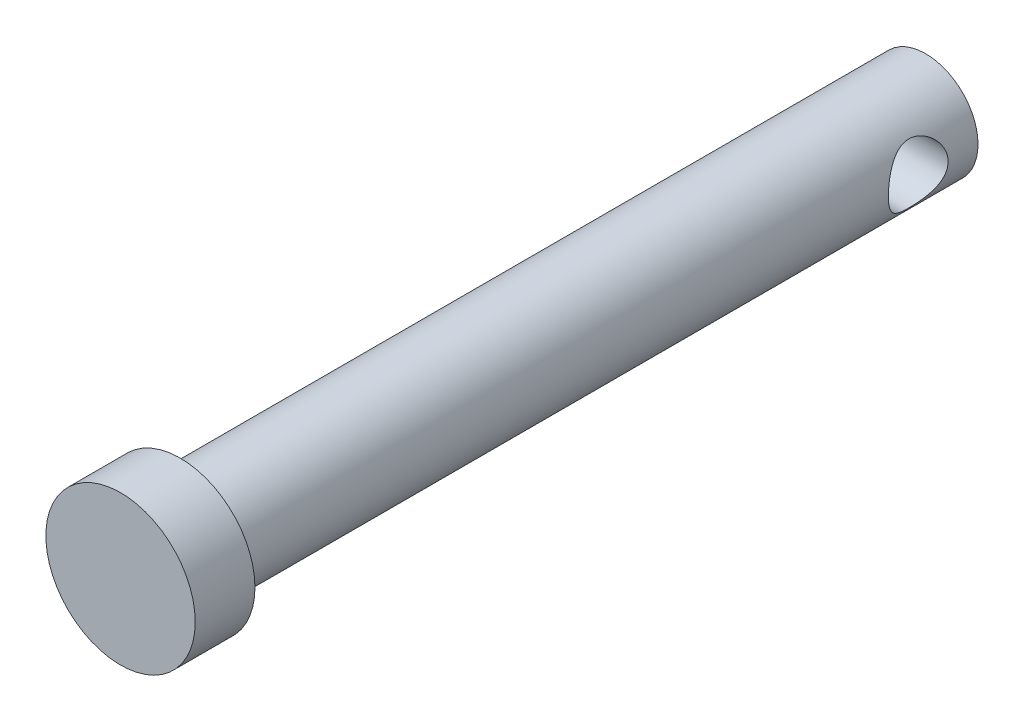
ISO-10303-21;
HEADER;
FILE_DESCRIPTION(('STEP AP214'),'2;1');
FILE_NAME('part.step','',(''),(''),'','','');
FILE_SCHEMA(('AUTOMOTIVE_DESIGN { 1 0 10303 214 1 1 1 1 }'));
ENDSEC;
DATA;
#1=APPLICATION_CONTEXT('core data for automotive mechanical design processes');
#2=APPLICATION_PROTOCOL_DEFINITION('international standard','automotive_design',2000,#1);
#3=PRODUCT_CONTEXT('',#1,'mechanical');
#4=PRODUCT('Part','Part','',(#3));
#5=PRODUCT_RELATED_PRODUCT_CATEGORY('part','',(#4));
#6=PRODUCT_DEFINITION_FORMATION('','',#4);
#7=PRODUCT_DEFINITION_CONTEXT('part definition',#1,'design');
#8=PRODUCT_DEFINITION('design','',#6,#7);
#9=PRODUCT_DEFINITION_SHAPE('','',#8);
#10=(LENGTH_UNIT() NAMED_UNIT(*) SI_UNIT(.MILLI.,.METRE.));
#11=(NAMED_UNIT(*) PLANE_ANGLE_UNIT() SI_UNIT($,.RADIAN.));
#12=(NAMED_UNIT(*) SI_UNIT($,.STERADIAN.) SOLID_ANGLE_UNIT());
#13=UNCERTAINTY_MEASURE_WITH_UNIT(LENGTH_MEASURE(1.E-05),#10,'distance_accuracy_value','');
#14=(GEOMETRIC_REPRESENTATION_CONTEXT(3) GLOBAL_UNCERTAINTY_ASSIGNED_CONTEXT((#13)) GLOBAL_UNIT_ASSIGNED_CONTEXT((#10,
#11,#12)) REPRESENTATION_CONTEXT('',''));
#15=CARTESIAN_POINT('',(0.,0.,0.));
#16=DIRECTION('',(0.,0.,1.));
#17=DIRECTION('',(1.,0.,0.));
#18=AXIS2_PLACEMENT_3D('',#15,#16,#17);
#19=CARTESIAN_POINT('',(0.,0.,0.));
#20=DIRECTION('',(0.,0.,1.));
#21=DIRECTION('',(1.,0.,0.));
#22=AXIS2_PLACEMENT_3D('',#19,#20,#21);
#23=CYLINDRICAL_SURFACE('',#22,8.75000000000001);
#24=CARTESIAN_POINT('',(8.75000000000001,0.,-57.5));
#25=CARTESIAN_POINT('',(8.74999899143932,-0.128967860426041,-57.4999988873856));
#26=CARTESIAN_POINT('',(8.74714118512553,-0.257975693991092,-57.4950022919481));
#27=CARTESIAN_POINT('',(8.73577804717564,-0.51502827530827,-57.4750761872122));
#28=CARTESIAN_POINT('',(8.72726918470832,-0.64307237029098,-57.4601404678472));
#29=CARTESIAN_POINT('',(8.70479591949282,-0.89741660904972,-57.4204917876841));
#30=CARTESIAN_POINT('',(8.69082066571583,-1.02371276357046,-57.3957593787775));
#31=CARTESIAN_POINT('',(8.65775561349406,-1.27343788282964,-57.3368198741511));
#32=CARTESIAN_POINT('',(8.63866363326812,-1.39686560000649,-57.3026087364739));
#33=CARTESIAN_POINT('',(8.59593192338099,-1.63936832817797,-57.2253125486778));
#34=CARTESIAN_POINT('',(8.57231648957784,-1.75846272056558,-57.1822748233246));
#35=CARTESIAN_POINT('',(8.52100513710846,-1.99231796977077,-57.0876574432639));
#36=CARTESIAN_POINT('',(8.49330766863481,-2.10707715977998,-57.0360745433224));
#37=CARTESIAN_POINT('',(8.40500554554115,-2.44378000950736,-56.8692760914431));
#38=CARTESIAN_POINT('',(8.33913351906791,-2.65846282664718,-56.7419094513411));
#39=CARTESIAN_POINT('',(8.19352835070925,-3.07924983168927,-56.4482667833856));
#40=CARTESIAN_POINT('',(8.11313763322376,-3.28361386492949,-56.2798445741146));
#41=CARTESIAN_POINT('',(7.94911679986266,-3.66289479952946,-55.9136259114097));
#42=CARTESIAN_POINT('',(7.86548297155776,-3.83777665031337,-55.7157950130608));
#43=CARTESIAN_POINT('',(7.69368241141025,-4.17238820695879,-55.2706942694034));
#44=CARTESIAN_POINT('',(7.60601081901439,-4.32840579236466,-55.0203880725344));
#45=CARTESIAN_POINT('',(7.48732871733404,-4.528627618394,-54.624480201928));
#46=CARTESIAN_POINT('',(7.44990905356926,-4.58972916126812,-54.4891191953705));
#47=CARTESIAN_POINT('',(7.38080725810791,-4.70004229445467,-54.2122516722928));
#48=CARTESIAN_POINT('',(7.34912325246575,-4.74925776992735,-54.0707471817639));
#49=CARTESIAN_POINT('',(7.27734050690413,-4.85893908118856,-53.7022424297169));
#50=CARTESIAN_POINT('',(7.24235738727829,-4.91044657846494,-53.471449434678));
#51=CARTESIAN_POINT('',(7.19452423963996,-4.98027881195367,-53.0028474709525));
#52=CARTESIAN_POINT('',(7.18165048675389,-4.99863911847061,-52.7650463016897));
#53=CARTESIAN_POINT('',(7.17985715136126,-5.00121579927444,-52.2888208812959));
#54=CARTESIAN_POINT('',(7.1909702823687,-4.98538554416675,-52.0503962227266));
#55=CARTESIAN_POINT('',(7.23557305100397,-4.92041312900133,-51.5802416033727));
#56=CARTESIAN_POINT('',(7.26907808435353,-4.87124804899479,-51.3485163632644));
#57=CARTESIAN_POINT('',(7.3538425515404,-4.74229410579026,-50.898338603151));
#58=CARTESIAN_POINT('',(7.40503287513213,-4.66262431898962,-50.6798382526693));
#59=CARTESIAN_POINT('',(7.51964771342102,-4.47542302998303,-50.2586237762793));
#60=CARTESIAN_POINT('',(7.58307690661132,-4.3678808677269,-50.0559157289483));
#61=CARTESIAN_POINT('',(7.7273177822965,-4.10810250362094,-49.6375740729523));
#62=CARTESIAN_POINT('',(7.80928613895577,-3.95146575714067,-49.4250747708425));
#63=CARTESIAN_POINT('',(7.97430872465577,-3.60684973623075,-49.02726405411));
#64=CARTESIAN_POINT('',(8.05736382322822,-3.41884374454083,-48.8419760705338));
#65=CARTESIAN_POINT('',(8.18178145620827,-3.10413963819043,-48.5775027309462));
#66=CARTESIAN_POINT('',(8.22533305073232,-2.9871162606479,-48.4876423991071));
#67=CARTESIAN_POINT('',(8.30931859089603,-2.74483760429682,-48.3181703377285));
#68=CARTESIAN_POINT('',(8.3497537012993,-2.61958543368039,-48.2385547717593));
#69=CARTESIAN_POINT('',(8.42637298223244,-2.36153627714243,-48.0903192052456));
#70=CARTESIAN_POINT('',(8.46255812652809,-2.2287410299006,-48.0216966846231));
#71=CARTESIAN_POINT('',(8.52962889317403,-1.9564208893549,-47.896209960206));
#72=CARTESIAN_POINT('',(8.56051517261517,-1.81689683321645,-47.8393442983112));
#73=CARTESIAN_POINT('',(8.6141154702888,-1.54199613747236,-47.7416352392982));
#74=CARTESIAN_POINT('',(8.63724632571279,-1.40699760303387,-47.69995704177));
#75=CARTESIAN_POINT('',(8.67742510216704,-1.13311132129589,-47.6280293801526));
#76=CARTESIAN_POINT('',(8.69447388312316,-0.994224126799221,-47.5977783003826));
#77=CARTESIAN_POINT('',(8.72196949323287,-0.713845010655519,-47.549176492856));
#78=CARTESIAN_POINT('',(8.73242139825561,-0.572355178055298,-47.5308166153035));
#79=CARTESIAN_POINT('',(8.74641743156534,-0.28798961500806,-47.5062617831562));
#80=CARTESIAN_POINT('',(8.74996233310143,-0.145114041496759,-47.5000654668324));
#81=CARTESIAN_POINT('',(8.75003254494902,0.123248535843138,-47.4999434418316));
#82=CARTESIAN_POINT('',(8.74735900095685,0.248737407032813,-47.5046172839));
#83=CARTESIAN_POINT('',(8.73666673854353,0.498821247290905,-47.5233640608992));
#84=CARTESIAN_POINT('',(8.72864638198892,0.623415930573509,-47.5374398763688));
#85=CARTESIAN_POINT('',(8.70745272957524,0.870721875400301,-47.57481254268));
#86=CARTESIAN_POINT('',(8.69428142228786,0.993433844806834,-47.5981058350714));
#87=CARTESIAN_POINT('',(8.66310017076885,1.23620833725116,-47.6536278698592));
#88=CARTESIAN_POINT('',(8.64508836060878,1.35626981921844,-47.6858600581957));
#89=CARTESIAN_POINT('',(8.58480031554475,1.70878109528973,-47.7946852636441));
#90=CARTESIAN_POINT('',(8.53601467526877,1.93638580026293,-47.8838451948721));
#91=CARTESIAN_POINT('',(8.42498494962223,2.37342763213177,-48.092546421804));
#92=CARTESIAN_POINT('',(8.36273762440095,2.58286036851134,-48.2120950324293));
#93=CARTESIAN_POINT('',(8.22243746460455,3.00126278411985,-48.4922324105876));
#94=CARTESIAN_POINT('',(8.14341387017987,3.20791515993108,-48.6557977556155));
#95=CARTESIAN_POINT('',(7.98126456368134,3.59243377528926,-49.0124047429156));
#96=CARTESIAN_POINT('',(7.89813423286805,3.77026659409319,-49.205480109763));
#97=CARTESIAN_POINT('',(7.7260544036741,4.11231717915448,-49.6410061251103));
#98=CARTESIAN_POINT('',(7.63748994897739,4.27280439758791,-49.8865619467716));
#99=CARTESIAN_POINT('',(7.47578366869892,4.54983467735247,-50.405886628181));
#100=CARTESIAN_POINT('',(7.4026214043184,4.66643613940155,-50.6796173717617));
#101=CARTESIAN_POINT('',(7.29628083803207,4.83055268275963,-51.1880881486004));
#102=CARTESIAN_POINT('',(7.25790263663577,4.88749883180399,-51.4186912174902));
#103=CARTESIAN_POINT('',(7.2029758105187,4.96810842213104,-51.8880852409359));
#104=CARTESIAN_POINT('',(7.18640234813968,4.99180973446422,-52.1268665608823));
#105=CARTESIAN_POINT('',(7.1774827895993,5.0046298227655,-52.6063068957164));
#106=CARTESIAN_POINT('',(7.18518547042859,4.99367897348607,-52.8469687205626));
#107=CARTESIAN_POINT('',(7.22375354547912,4.93770946687113,-53.3224429825996));
#108=CARTESIAN_POINT('',(7.25463358954822,4.89266926233159,-53.5572516231065));
#109=CARTESIAN_POINT('',(7.33459503620321,4.77192657388339,-54.0109386947904));
#110=CARTESIAN_POINT('',(7.38335227025487,4.6967680992956,-54.2300224601053));
#111=CARTESIAN_POINT('',(7.49373941466472,4.51855300291661,-54.6529991754065));
#112=CARTESIAN_POINT('',(7.55537407001274,4.41548609344827,-54.8568864882245));
#113=CARTESIAN_POINT('',(7.69608556942828,4.16608669020863,-55.2771021502592));
#114=CARTESIAN_POINT('',(7.77638680459788,4.01553579229108,-55.490511731197));
#115=CARTESIAN_POINT('',(7.93907840273347,3.68343512853148,-55.8911688262313));
#116=CARTESIAN_POINT('',(8.02147052488323,3.50185846942674,-56.0783933848241));
#117=CARTESIAN_POINT('',(8.1461873024024,3.19629661700371,-56.3477551965533));
#118=CARTESIAN_POINT('',(8.19028295366971,3.08183258742075,-56.440053916032));
#119=CARTESIAN_POINT('',(8.27568243976121,2.84454773116869,-56.6146351736945));
#120=CARTESIAN_POINT('',(8.31698728498757,2.72172996161156,-56.6969213456238));
#121=CARTESIAN_POINT('',(8.39566853903589,2.46836977835854,-56.8507604859725));
#122=CARTESIAN_POINT('',(8.43304532816924,2.33782811440055,-56.922314493759));
#123=CARTESIAN_POINT('',(8.50279673917487,2.06980770077492,-57.0539178187812));
#124=CARTESIAN_POINT('',(8.53517273869683,1.93233087554458,-57.1139703056278));
#125=CARTESIAN_POINT('',(8.58871834374186,1.67640860202281,-57.2122139177791));
#126=CARTESIAN_POINT('',(8.61085695040126,1.55892525419862,-57.2523935608994));
#127=CARTESIAN_POINT('',(8.65061331029371,1.32059631066416,-57.3240544006406));
#128=CARTESIAN_POINT('',(8.66823186304956,1.1997513137715,-57.3555371356764));
#129=CARTESIAN_POINT('',(8.69851197885606,0.955755229239806,-57.4093894710432));
#130=CARTESIAN_POINT('',(8.71118564012015,0.832610552226699,-57.4317813187339));
#131=CARTESIAN_POINT('',(8.7313332081311,0.584617815083984,-57.4672824637319));
#132=CARTESIAN_POINT('',(8.73881007306015,0.459770765337694,-57.4803970420325));
#133=CARTESIAN_POINT('',(8.74573194749783,0.278891824250344,-57.4925278355362));
#134=CARTESIAN_POINT('',(8.74733140190726,0.223168056039698,-57.495328726467));
#135=CARTESIAN_POINT('',(8.74946570226123,0.111632027086561,-57.499065147321));
#136=CARTESIAN_POINT('',(8.75000043652438,0.0558197576753702,-57.5000004815608));
#137=CARTESIAN_POINT('',(8.75000000000001,0.,-57.5));
#138=B_SPLINE_CURVE_WITH_KNOTS('',3,(#24,#25,#26,#27,#28,#29,#30,#31,#32,#33,#34,#35,#36,#37,
#38,#39,#40,#41,#42,#43,#44,#45,#46,#47,#48,#49,#50,#51,#52,#53,#54,#55,#56,#57,#58,#59,#60,#61,
#62,#63,#64,#65,#66,#67,#68,#69,#70,#71,#72,#73,#74,#75,#76,#77,#78,#79,#80,#81,#82,#83,#84,#85,
#86,#87,#88,#89,#90,#91,#92,#93,#94,#95,#96,#97,#98,#99,#100,#101,#102,#103,#104,#105,#106,#107,
#108,#109,#110,#111,#112,#113,#114,#115,#116,#117,#118,#119,#120,#121,#122,#123,#124,#125,#126,
#127,#128,#129,#130,#131,#132,#133,#134,#135,#136,#137),.UNSPECIFIED.,.T.,.F.,(4,2,2,2,2,2,2,2,
2,2,2,2,2,2,2,2,2,2,2,2,2,2,2,2,2,2,2,2,2,2,2,2,2,2,2,2,2,2,2,2,2,2,2,2,2,2,2,2,2,2,2,2,2,2,2,2,
4),(0.,0.386845405058941,0.773932742319245,1.16179239674328,1.54981769906418,1.93581453569218,
2.32195830131254,3.0932526896355,3.92026707841388,4.74825785270365,5.66623148603118,
6.12511505478498,6.58384842613308,7.29762978219456,8.01064472200142,8.72463269194207,
9.4391120754447,10.1508304331471,10.8628213968974,11.6889099035546,12.5157056172,
12.9767172228832,13.4375556847493,13.8982883509996,14.3589638422894,14.787852636959,
15.2166807683009,15.6451785406097,16.0736283392116,16.4499800128818,16.8264470445841,
17.2027688809889,17.5792359914215,18.3236540520218,19.0682514729897,19.8903533136246,
20.7134017903678,21.6282450041381,22.5418664545776,23.2606149709009,23.9785440538439,
24.6979165591871,25.4177441457245,26.1251171108573,26.8327511853953,27.6493510191049,
28.4666623095394,28.9267025228087,29.3865752775275,29.8464034666194,30.3061047524798,
30.68407351473,31.0619753743891,31.4389467699392,31.8157034052214,31.9831199386142,
32.1505540318595),.UNSPECIFIED.);
#139=CARTESIAN_POINT('',(8.75000000000001,0.,-57.5));
#140=VERTEX_POINT('',#139);
#141=EDGE_CURVE('E46',#140,#140,#138,.T.);
#142=ORIENTED_EDGE('',*,*,#141,.T.);
#143=EDGE_LOOP('',(#142));
#144=FACE_BOUND('',#143,.T.);
#145=CARTESIAN_POINT('',(-8.75000000000001,0.,-57.5));
#146=CARTESIAN_POINT('',(-8.74999899143932,0.128967860426041,-57.4999988873856));
#147=CARTESIAN_POINT('',(-8.74714118512553,0.257975693991092,-57.4950022919481));
#148=CARTESIAN_POINT('',(-8.73577804717564,0.51502827530827,-57.4750761872122));
#149=CARTESIAN_POINT('',(-8.72726918470832,0.64307237029098,-57.4601404678472));
#150=CARTESIAN_POINT('',(-8.70479591949282,0.89741660904972,-57.4204917876841));
#151=CARTESIAN_POINT('',(-8.69082066571583,1.02371276357046,-57.3957593787775));
#152=CARTESIAN_POINT('',(-8.65775561349406,1.27343788282964,-57.3368198741511));
#153=CARTESIAN_POINT('',(-8.63866363326812,1.39686560000649,-57.3026087364739));
#154=CARTESIAN_POINT('',(-8.59593192338099,1.63936832817797,-57.2253125486778));
#155=CARTESIAN_POINT('',(-8.57231648957784,1.75846272056558,-57.1822748233246));
#156=CARTESIAN_POINT('',(-8.52100513710846,1.99231796977077,-57.0876574432639));
#157=CARTESIAN_POINT('',(-8.49330766863481,2.10707715977998,-57.0360745433224));
#158=CARTESIAN_POINT('',(-8.40500554554115,2.44378000950736,-56.8692760914431));
#159=CARTESIAN_POINT('',(-8.33913351906791,2.65846282664718,-56.7419094513411));
#160=CARTESIAN_POINT('',(-8.19352835070925,3.07924983168927,-56.4482667833856));
#161=CARTESIAN_POINT('',(-8.11313763322376,3.28361386492949,-56.2798445741146));
#162=CARTESIAN_POINT('',(-7.94911679986266,3.66289479952946,-55.9136259114097));
#163=CARTESIAN_POINT('',(-7.86548297155776,3.83777665031337,-55.7157950130608));
#164=CARTESIAN_POINT('',(-7.69368241141025,4.17238820695879,-55.2706942694034));
#165=CARTESIAN_POINT('',(-7.60601081901439,4.32840579236466,-55.0203880725344));
#166=CARTESIAN_POINT('',(-7.48732871733404,4.528627618394,-54.624480201928));
#167=CARTESIAN_POINT('',(-7.44990905356926,4.58972916126812,-54.4891191953705));
#168=CARTESIAN_POINT('',(-7.38080725810791,4.70004229445467,-54.2122516722928));
#169=CARTESIAN_POINT('',(-7.34912325246575,4.74925776992735,-54.0707471817639));
#170=CARTESIAN_POINT('',(-7.27734050690413,4.85893908118856,-53.7022424297169));
#171=CARTESIAN_POINT('',(-7.24235738727829,4.91044657846494,-53.471449434678));
#172=CARTESIAN_POINT('',(-7.19452423963996,4.98027881195367,-53.0028474709525));
#173=CARTESIAN_POINT('',(-7.18165048675389,4.99863911847061,-52.7650463016897));
#174=CARTESIAN_POINT('',(-7.17985715136126,5.00121579927444,-52.2888208812959));
#175=CARTESIAN_POINT('',(-7.1909702823687,4.98538554416675,-52.0503962227266));
#176=CARTESIAN_POINT('',(-7.23557305100397,4.92041312900133,-51.5802416033727));
#177=CARTESIAN_POINT('',(-7.26907808435353,4.87124804899479,-51.3485163632644));
#178=CARTESIAN_POINT('',(-7.3538425515404,4.74229410579026,-50.898338603151));
#179=CARTESIAN_POINT('',(-7.40503287513213,4.66262431898962,-50.6798382526693));
#180=CARTESIAN_POINT('',(-7.51964771342102,4.47542302998303,-50.2586237762793));
#181=CARTESIAN_POINT('',(-7.58307690661132,4.3678808677269,-50.0559157289483));
#182=CARTESIAN_POINT('',(-7.7273177822965,4.10810250362094,-49.6375740729523));
#183=CARTESIAN_POINT('',(-7.80928613895577,3.95146575714067,-49.4250747708425));
#184=CARTESIAN_POINT('',(-7.97430872465577,3.60684973623075,-49.02726405411));
#185=CARTESIAN_POINT('',(-8.05736382322822,3.41884374454083,-48.8419760705338));
#186=CARTESIAN_POINT('',(-8.18178145620827,3.10413963819043,-48.5775027309462));
#187=CARTESIAN_POINT('',(-8.22533305073232,2.9871162606479,-48.4876423991071));
#188=CARTESIAN_POINT('',(-8.30931859089603,2.74483760429682,-48.3181703377285));
#189=CARTESIAN_POINT('',(-8.3497537012993,2.61958543368039,-48.2385547717593));
#190=CARTESIAN_POINT('',(-8.42637298223244,2.36153627714243,-48.0903192052456));
#191=CARTESIAN_POINT('',(-8.46255812652809,2.2287410299006,-48.0216966846231));
#192=CARTESIAN_POINT('',(-8.52962889317403,1.9564208893549,-47.896209960206));
#193=CARTESIAN_POINT('',(-8.56051517261517,1.81689683321645,-47.8393442983112));
#194=CARTESIAN_POINT('',(-8.6141154702888,1.54199613747236,-47.7416352392982));
#195=CARTESIAN_POINT('',(-8.63724632571279,1.40699760303387,-47.69995704177));
#196=CARTESIAN_POINT('',(-8.67742510216704,1.13311132129589,-47.6280293801526));
#197=CARTESIAN_POINT('',(-8.69447388312316,0.994224126799221,-47.5977783003826));
#198=CARTESIAN_POINT('',(-8.72196949323287,0.713845010655519,-47.549176492856));
#199=CARTESIAN_POINT('',(-8.73242139825561,0.572355178055298,-47.5308166153035));
#200=CARTESIAN_POINT('',(-8.74641743156534,0.28798961500806,-47.5062617831562));
#201=CARTESIAN_POINT('',(-8.74996233310143,0.145114041496759,-47.5000654668324));
#202=CARTESIAN_POINT('',(-8.75003254494902,-0.123248535843138,-47.4999434418316));
#203=CARTESIAN_POINT('',(-8.74735900095685,-0.248737407032813,-47.5046172839));
#204=CARTESIAN_POINT('',(-8.73666673854353,-0.498821247290905,-47.5233640608992));
#205=CARTESIAN_POINT('',(-8.72864638198892,-0.623415930573509,-47.5374398763688));
#206=CARTESIAN_POINT('',(-8.70745272957524,-0.870721875400301,-47.57481254268));
#207=CARTESIAN_POINT('',(-8.69428142228786,-0.993433844806834,-47.5981058350714));
#208=CARTESIAN_POINT('',(-8.66310017076885,-1.23620833725116,-47.6536278698592));
#209=CARTESIAN_POINT('',(-8.64508836060878,-1.35626981921844,-47.6858600581957));
#210=CARTESIAN_POINT('',(-8.58480031554475,-1.70878109528973,-47.7946852636441));
#211=CARTESIAN_POINT('',(-8.53601467526877,-1.93638580026293,-47.8838451948721));
#212=CARTESIAN_POINT('',(-8.42498494962223,-2.37342763213177,-48.092546421804));
#213=CARTESIAN_POINT('',(-8.36273762440095,-2.58286036851134,-48.2120950324293));
#214=CARTESIAN_POINT('',(-8.22243746460455,-3.00126278411985,-48.4922324105876));
#215=CARTESIAN_POINT('',(-8.14341387017987,-3.20791515993108,-48.6557977556155));
#216=CARTESIAN_POINT('',(-7.98126456368134,-3.59243377528926,-49.0124047429156));
#217=CARTESIAN_POINT('',(-7.89813423286805,-3.77026659409319,-49.205480109763));
#218=CARTESIAN_POINT('',(-7.7260544036741,-4.11231717915448,-49.6410061251103));
#219=CARTESIAN_POINT('',(-7.63748994897739,-4.27280439758791,-49.8865619467716));
#220=CARTESIAN_POINT('',(-7.47578366869892,-4.54983467735247,-50.405886628181));
#221=CARTESIAN_POINT('',(-7.4026214043184,-4.66643613940155,-50.6796173717617));
#222=CARTESIAN_POINT('',(-7.29628083803207,-4.83055268275963,-51.1880881486004));
#223=CARTESIAN_POINT('',(-7.25790263663577,-4.88749883180399,-51.4186912174902));
#224=CARTESIAN_POINT('',(-7.2029758105187,-4.96810842213104,-51.8880852409359));
#225=CARTESIAN_POINT('',(-7.18640234813968,-4.99180973446422,-52.1268665608823));
#226=CARTESIAN_POINT('',(-7.1774827895993,-5.0046298227655,-52.6063068957164));
#227=CARTESIAN_POINT('',(-7.18518547042859,-4.99367897348607,-52.8469687205626));
#228=CARTESIAN_POINT('',(-7.22375354547912,-4.93770946687113,-53.3224429825996));
#229=CARTESIAN_POINT('',(-7.25463358954822,-4.89266926233159,-53.5572516231065));
#230=CARTESIAN_POINT('',(-7.33459503620321,-4.77192657388339,-54.0109386947904));
#231=CARTESIAN_POINT('',(-7.38335227025487,-4.6967680992956,-54.2300224601053));
#232=CARTESIAN_POINT('',(-7.49373941466472,-4.51855300291661,-54.6529991754065));
#233=CARTESIAN_POINT('',(-7.55537407001274,-4.41548609344827,-54.8568864882245));
#234=CARTESIAN_POINT('',(-7.69608556942828,-4.16608669020863,-55.2771021502592));
#235=CARTESIAN_POINT('',(-7.77638680459788,-4.01553579229108,-55.490511731197));
#236=CARTESIAN_POINT('',(-7.93907840273347,-3.68343512853148,-55.8911688262313));
#237=CARTESIAN_POINT('',(-8.02147052488323,-3.50185846942674,-56.0783933848241));
#238=CARTESIAN_POINT('',(-8.1461873024024,-3.19629661700371,-56.3477551965533));
#239=CARTESIAN_POINT('',(-8.19028295366971,-3.08183258742075,-56.440053916032));
#240=CARTESIAN_POINT('',(-8.27568243976121,-2.84454773116869,-56.6146351736945));
#241=CARTESIAN_POINT('',(-8.31698728498757,-2.72172996161156,-56.6969213456238));
#242=CARTESIAN_POINT('',(-8.39566853903589,-2.46836977835854,-56.8507604859725));
#243=CARTESIAN_POINT('',(-8.43304532816924,-2.33782811440055,-56.922314493759));
#244=CARTESIAN_POINT('',(-8.50279673917487,-2.06980770077492,-57.0539178187812));
#245=CARTESIAN_POINT('',(-8.53517273869683,-1.93233087554458,-57.1139703056278));
#246=CARTESIAN_POINT('',(-8.58871834374186,-1.67640860202281,-57.2122139177791));
#247=CARTESIAN_POINT('',(-8.61085695040126,-1.55892525419862,-57.2523935608994));
#248=CARTESIAN_POINT('',(-8.65061331029371,-1.32059631066416,-57.3240544006406));
#249=CARTESIAN_POINT('',(-8.66823186304956,-1.1997513137715,-57.3555371356764));
#250=CARTESIAN_POINT('',(-8.69851197885606,-0.955755229239806,-57.4093894710432));
#251=CARTESIAN_POINT('',(-8.71118564012015,-0.832610552226699,-57.4317813187339));
#252=CARTESIAN_POINT('',(-8.7313332081311,-0.584617815083984,-57.4672824637319));
#253=CARTESIAN_POINT('',(-8.73881007306015,-0.459770765337694,-57.4803970420325));
#254=CARTESIAN_POINT('',(-8.74573194749783,-0.278891824250344,-57.4925278355362));
#255=CARTESIAN_POINT('',(-8.74733140190726,-0.223168056039698,-57.495328726467));
#256=CARTESIAN_POINT('',(-8.74946570226123,-0.111632027086561,-57.499065147321));
#257=CARTESIAN_POINT('',(-8.75000043652438,-0.0558197576753702,-57.5000004815608));
#258=CARTESIAN_POINT('',(-8.75000000000001,0.,-57.5));
#259=B_SPLINE_CURVE_WITH_KNOTS('',3,(#145,#146,#147,#148,#149,#150,#151,#152,#153,#154,#155,
#156,#157,#158,#159,#160,#161,#162,#163,#164,#165,#166,#167,#168,#169,#170,#171,#172,#173,#174,
#175,#176,#177,#178,#179,#180,#181,#182,#183,#184,#185,#186,#187,#188,#189,#190,#191,#192,#193,
#194,#195,#196,#197,#198,#199,#200,#201,#202,#203,#204,#205,#206,#207,#208,#209,#210,#211,#212,
#213,#214,#215,#216,#217,#218,#219,#220,#221,#222,#223,#224,#225,#226,#227,#228,#229,#230,#231,
#232,#233,#234,#235,#236,#237,#238,#239,#240,#241,#242,#243,#244,#245,#246,#247,#248,#249,#250,
#251,#252,#253,#254,#255,#256,#257,#258),.UNSPECIFIED.,.T.,.F.,(4,2,2,2,2,2,2,2,2,2,2,2,2,2,2,2,
2,2,2,2,2,2,2,2,2,2,2,2,2,2,2,2,2,2,2,2,2,2,2,2,2,2,2,2,2,2,2,2,2,2,2,2,2,2,2,2,4),(0.,
0.386845405058941,0.773932742319245,1.16179239674328,1.54981769906418,1.93581453569218,
2.32195830131254,3.0932526896355,3.92026707841388,4.74825785270365,5.66623148603118,
6.12511505478498,6.58384842613308,7.29762978219456,8.01064472200142,8.72463269194207,
9.4391120754447,10.1508304331471,10.8628213968974,11.6889099035546,12.5157056172,
12.9767172228832,13.4375556847493,13.8982883509996,14.3589638422894,14.787852636959,
15.2166807683009,15.6451785406097,16.0736283392116,16.4499800128818,16.8264470445841,
17.2027688809889,17.5792359914215,18.3236540520218,19.0682514729897,19.8903533136246,
20.7134017903678,21.6282450041381,22.5418664545776,23.2606149709009,23.9785440538439,
24.6979165591871,25.4177441457245,26.1251171108573,26.8327511853953,27.6493510191049,
28.4666623095394,28.9267025228087,29.3865752775275,29.8464034666194,30.3061047524798,
30.68407351473,31.0619753743891,31.4389467699392,31.8157034052214,31.9831199386142,
32.1505540318595),.UNSPECIFIED.);
#260=CARTESIAN_POINT('',(-8.75000000000001,0.,-57.5));
#261=VERTEX_POINT('',#260);
#262=EDGE_CURVE('E62',#261,#261,#259,.T.);
#263=ORIENTED_EDGE('',*,*,#262,.T.);
#264=EDGE_LOOP('',(#263));
#265=FACE_BOUND('',#264,.T.);
#266=CARTESIAN_POINT('',(0.,0.,62.5));
#267=DIRECTION('',(0.,0.,1.));
#268=DIRECTION('',(1.,0.,0.));
#269=AXIS2_PLACEMENT_3D('',#266,#267,#268);
#270=CIRCLE('',#269,8.75000000000001);
#271=CARTESIAN_POINT('',(8.75000000000001,0.,62.5));
#272=VERTEX_POINT('',#271);
#273=EDGE_CURVE('E11',#272,#272,#270,.T.);
#274=ORIENTED_EDGE('',*,*,#273,.F.);
#275=EDGE_LOOP('',(#274));
#276=FACE_BOUND('',#275,.T.);
#277=CARTESIAN_POINT('',(0.,0.,-62.5));
#278=DIRECTION('',(0.,0.,1.));
#279=DIRECTION('',(1.,0.,0.));
#280=AXIS2_PLACEMENT_3D('',#277,#278,#279);
#281=CIRCLE('',#280,8.75000000000001);
#282=CARTESIAN_POINT('',(8.75000000000001,0.,-62.5));
#283=VERTEX_POINT('',#282);
#284=EDGE_CURVE('E54',#283,#283,#281,.T.);
#285=ORIENTED_EDGE('',*,*,#284,.T.);
#286=EDGE_LOOP('',(#285));
#287=FACE_BOUND('',#286,.T.);
#288=ADVANCED_FACE('F42',(#144,#265,#276,#287),#23,.T.);
#289=CARTESIAN_POINT('',(0.,0.,-62.5));
#290=DIRECTION('',(0.,0.,1.));
#291=DIRECTION('',(1.,0.,0.));
#292=AXIS2_PLACEMENT_3D('',#289,#290,#291);
#293=PLANE('',#292);
#294=ORIENTED_EDGE('',*,*,#284,.F.);
#295=EDGE_LOOP('',(#294));
#296=FACE_BOUND('',#295,.T.);
#297=ADVANCED_FACE('F79',(#296),#293,.F.);
#298=CARTESIAN_POINT('',(0.,0.,62.5));
#299=DIRECTION('',(0.,0.,1.));
#300=DIRECTION('',(1.,0.,0.));
#301=AXIS2_PLACEMENT_3D('',#298,#299,#300);
#302=PLANE('',#301);
#303=ORIENTED_EDGE('',*,*,#273,.T.);
#304=EDGE_LOOP('',(#303));
#305=FACE_BOUND('',#304,.T.);
#306=CARTESIAN_POINT('',(0.232114027866714,0.249851337689178,62.5));
#307=DIRECTION('',(0.,0.,1.));
#308=DIRECTION('',(1.,0.,0.));
#309=AXIS2_PLACEMENT_3D('',#306,#307,#308);
#310=CIRCLE('',#309,12.5);
#311=CARTESIAN_POINT('',(12.7321140278667,0.249851337689178,62.5));
#312=VERTEX_POINT('',#311);
#313=EDGE_CURVE('E100',#312,#312,#310,.T.);
#314=ORIENTED_EDGE('',*,*,#313,.F.);
#315=EDGE_LOOP('',(#314));
#316=FACE_BOUND('',#315,.T.);
#317=ADVANCED_FACE('F73',(#305,#316),#302,.F.);
#318=CARTESIAN_POINT('',(0.,0.,72.5));
#319=DIRECTION('',(0.,0.,1.));
#320=DIRECTION('',(1.,0.,0.));
#321=AXIS2_PLACEMENT_3D('',#318,#319,#320);
#322=PLANE('',#321);
#323=CARTESIAN_POINT('',(0.232114027866714,0.249851337689178,72.5));
#324=DIRECTION('',(0.,0.,1.));
#325=DIRECTION('',(1.,0.,0.));
#326=AXIS2_PLACEMENT_3D('',#323,#324,#325);
#327=CIRCLE('',#326,12.5);
#328=CARTESIAN_POINT('',(12.7321140278667,0.249851337689178,72.5));
#329=VERTEX_POINT('',#328);
#330=EDGE_CURVE('E59',#329,#329,#327,.T.);
#331=ORIENTED_EDGE('',*,*,#330,.T.);
#332=EDGE_LOOP('',(#331));
#333=FACE_BOUND('',#332,.T.);
#334=ADVANCED_FACE('F77',(#333),#322,.T.);
#335=CARTESIAN_POINT('',(0.232114027866714,0.249851337689178,62.5));
#336=DIRECTION('',(0.,0.,1.));
#337=DIRECTION('',(1.,0.,0.));
#338=AXIS2_PLACEMENT_3D('',#335,#336,#337);
#339=CYLINDRICAL_SURFACE('',#338,12.5);
#340=ORIENTED_EDGE('',*,*,#313,.T.);
#341=EDGE_LOOP('',(#340));
#342=FACE_BOUND('',#341,.T.);
#343=ORIENTED_EDGE('',*,*,#330,.F.);
#344=EDGE_LOOP('',(#343));
#345=FACE_BOUND('',#344,.T.);
#346=ADVANCED_FACE('F71',(#342,#345),#339,.T.);
#347=CARTESIAN_POINT('',(-12.2678859721333,0.,-52.5));
#348=DIRECTION('',(1.,0.,0.));
#349=DIRECTION('',(0.,0.,-1.));
#350=AXIS2_PLACEMENT_3D('',#347,#348,#349);
#351=CYLINDRICAL_SURFACE('',#350,5.);
#352=ORIENTED_EDGE('',*,*,#262,.F.);
#353=EDGE_LOOP('',(#352));
#354=FACE_BOUND('',#353,.T.);
#355=ORIENTED_EDGE('',*,*,#141,.F.);
#356=EDGE_LOOP('',(#355));
#357=FACE_BOUND('',#356,.T.);
#358=ADVANCED_FACE('F67',(#354,#357),#351,.F.);
#359=CLOSED_SHELL('',(#288,#297,#317,#334,#346,#358));
#360=MANIFOLD_SOLID_BREP('B2',#359);
#361=ADVANCED_BREP_SHAPE_REPRESENTATION('',(#18,#360),#14);
#362=SHAPE_DEFINITION_REPRESENTATION(#9,#361);
ENDSEC;
END-ISO-10303-21;
